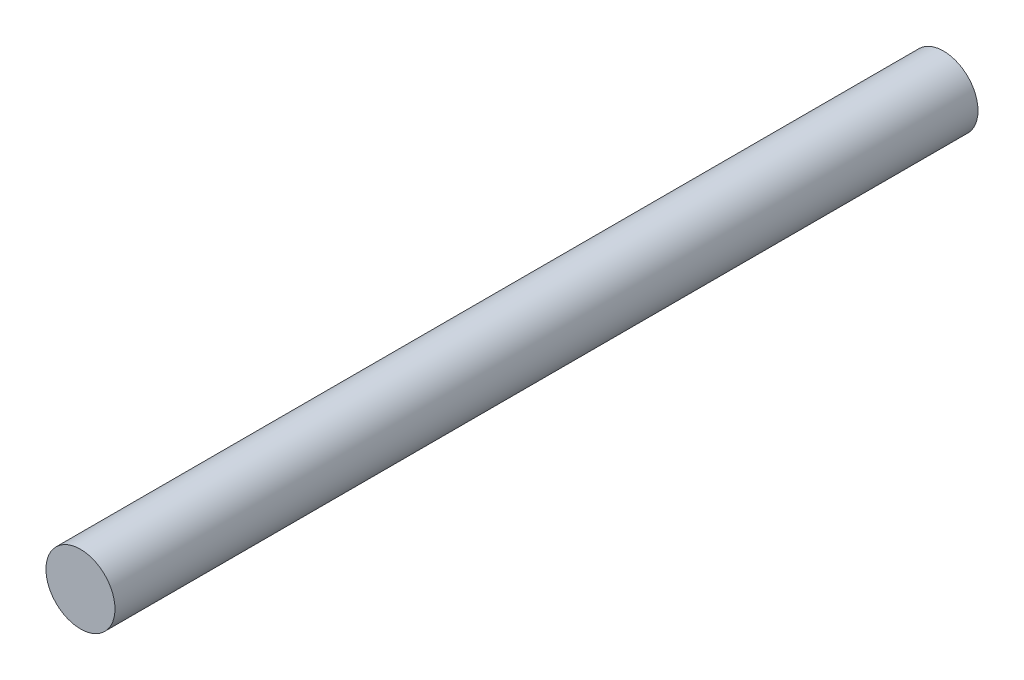
ISO-10303-21;
HEADER;
FILE_DESCRIPTION(('STEP AP214'),'2;1');
FILE_NAME('part.step','',(''),(''),'','','');
FILE_SCHEMA(('AUTOMOTIVE_DESIGN { 1 0 10303 214 1 1 1 1 }'));
ENDSEC;
DATA;
#1=APPLICATION_CONTEXT('core data for automotive mechanical design processes');
#2=APPLICATION_PROTOCOL_DEFINITION('international standard','automotive_design',2000,#1);
#3=PRODUCT_CONTEXT('',#1,'mechanical');
#4=PRODUCT('Part','Part','',(#3));
#5=PRODUCT_RELATED_PRODUCT_CATEGORY('part','',(#4));
#6=PRODUCT_DEFINITION_FORMATION('','',#4);
#7=PRODUCT_DEFINITION_CONTEXT('part definition',#1,'design');
#8=PRODUCT_DEFINITION('design','',#6,#7);
#9=PRODUCT_DEFINITION_SHAPE('','',#8);
#10=(LENGTH_UNIT() NAMED_UNIT(*) SI_UNIT(.MILLI.,.METRE.));
#11=(NAMED_UNIT(*) PLANE_ANGLE_UNIT() SI_UNIT($,.RADIAN.));
#12=(NAMED_UNIT(*) SI_UNIT($,.STERADIAN.) SOLID_ANGLE_UNIT());
#13=UNCERTAINTY_MEASURE_WITH_UNIT(LENGTH_MEASURE(1.E-05),#10,'distance_accuracy_value','');
#14=(GEOMETRIC_REPRESENTATION_CONTEXT(3) GLOBAL_UNCERTAINTY_ASSIGNED_CONTEXT((#13)) GLOBAL_UNIT_ASSIGNED_CONTEXT((#10,
#11,#12)) REPRESENTATION_CONTEXT('',''));
#15=CARTESIAN_POINT('',(0.,0.,0.));
#16=DIRECTION('',(0.,0.,1.));
#17=DIRECTION('',(1.,0.,0.));
#18=AXIS2_PLACEMENT_3D('',#15,#16,#17);
#19=CARTESIAN_POINT('',(0.,0.,100.));
#20=DIRECTION('',(0.,0.,-1.));
#21=DIRECTION('',(-1.,0.,0.));
#22=AXIS2_PLACEMENT_3D('',#19,#20,#21);
#23=CYLINDRICAL_SURFACE('',#22,4.);
#24=CARTESIAN_POINT('',(0.,0.,100.));
#25=DIRECTION('',(0.,0.,1.));
#26=DIRECTION('',(1.,0.,0.));
#27=AXIS2_PLACEMENT_3D('',#24,#25,#26);
#28=CIRCLE('',#27,4.);
#29=CARTESIAN_POINT('',(4.,0.,100.));
#30=VERTEX_POINT('',#29);
#31=EDGE_CURVE('E12',#30,#30,#28,.T.);
#32=ORIENTED_EDGE('',*,*,#31,.F.);
#33=EDGE_LOOP('',(#32));
#34=FACE_BOUND('',#33,.T.);
#35=CARTESIAN_POINT('',(0.,0.,0.));
#36=DIRECTION('',(0.,0.,1.));
#37=DIRECTION('',(1.,0.,0.));
#38=AXIS2_PLACEMENT_3D('',#35,#36,#37);
#39=CIRCLE('',#38,4.);
#40=CARTESIAN_POINT('',(4.,0.,0.));
#41=VERTEX_POINT('',#40);
#42=EDGE_CURVE('E45',#41,#41,#39,.T.);
#43=ORIENTED_EDGE('',*,*,#42,.T.);
#44=EDGE_LOOP('',(#43));
#45=FACE_BOUND('',#44,.T.);
#46=ADVANCED_FACE('F42',(#34,#45),#23,.T.);
#47=CARTESIAN_POINT('',(0.,0.,100.));
#48=DIRECTION('',(0.,0.,1.));
#49=DIRECTION('',(1.,0.,0.));
#50=AXIS2_PLACEMENT_3D('',#47,#48,#49);
#51=PLANE('',#50);
#52=ORIENTED_EDGE('',*,*,#31,.T.);
#53=EDGE_LOOP('',(#52));
#54=FACE_BOUND('',#53,.T.);
#55=ADVANCED_FACE('F57',(#54),#51,.T.);
#56=CARTESIAN_POINT('',(0.,0.,0.));
#57=DIRECTION('',(0.,0.,1.));
#58=DIRECTION('',(1.,0.,0.));
#59=AXIS2_PLACEMENT_3D('',#56,#57,#58);
#60=PLANE('',#59);
#61=ORIENTED_EDGE('',*,*,#42,.F.);
#62=EDGE_LOOP('',(#61));
#63=FACE_BOUND('',#62,.T.);
#64=ADVANCED_FACE('F55',(#63),#60,.F.);
#65=CLOSED_SHELL('',(#46,#55,#64));
#66=MANIFOLD_SOLID_BREP('B2',#65);
#67=ADVANCED_BREP_SHAPE_REPRESENTATION('',(#18,#66),#14);
#68=SHAPE_DEFINITION_REPRESENTATION(#9,#67);
ENDSEC;
END-ISO-10303-21;
